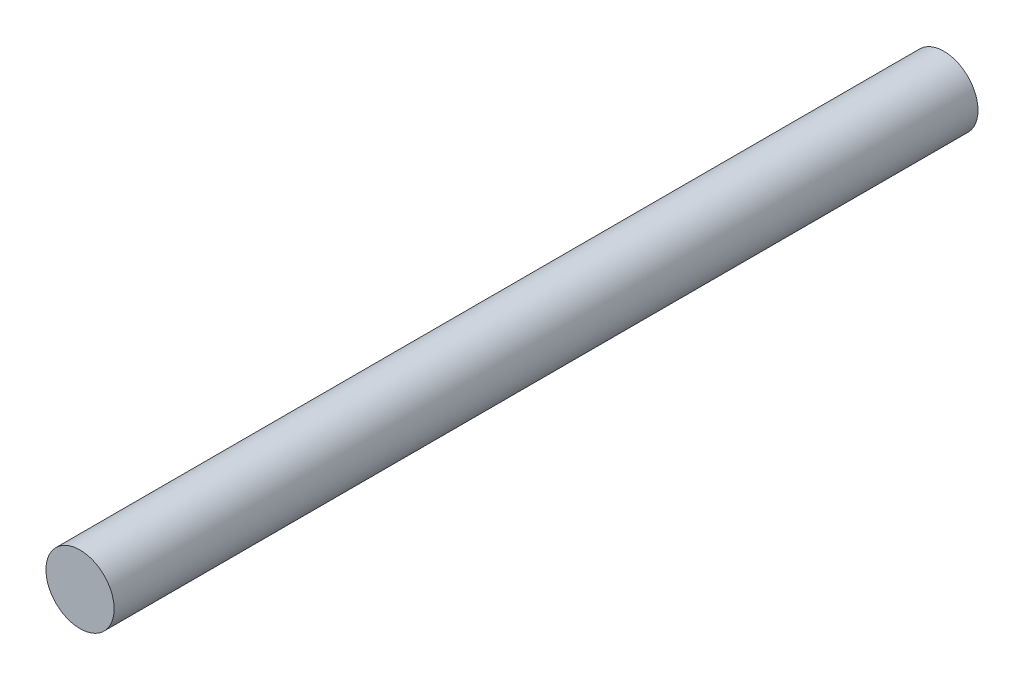
ISO-10303-21;
HEADER;
FILE_DESCRIPTION(('STEP AP214'),'2;1');
FILE_NAME('part.step','',(''),(''),'','','');
FILE_SCHEMA(('AUTOMOTIVE_DESIGN { 1 0 10303 214 1 1 1 1 }'));
ENDSEC;
DATA;
#1=APPLICATION_CONTEXT('core data for automotive mechanical design processes');
#2=APPLICATION_PROTOCOL_DEFINITION('international standard','automotive_design',2000,#1);
#3=PRODUCT_CONTEXT('',#1,'mechanical');
#4=PRODUCT('Part','Part','',(#3));
#5=PRODUCT_RELATED_PRODUCT_CATEGORY('part','',(#4));
#6=PRODUCT_DEFINITION_FORMATION('','',#4);
#7=PRODUCT_DEFINITION_CONTEXT('part definition',#1,'design');
#8=PRODUCT_DEFINITION('design','',#6,#7);
#9=PRODUCT_DEFINITION_SHAPE('','',#8);
#10=(LENGTH_UNIT() NAMED_UNIT(*) SI_UNIT(.MILLI.,.METRE.));
#11=(NAMED_UNIT(*) PLANE_ANGLE_UNIT() SI_UNIT($,.RADIAN.));
#12=(NAMED_UNIT(*) SI_UNIT($,.STERADIAN.) SOLID_ANGLE_UNIT());
#13=UNCERTAINTY_MEASURE_WITH_UNIT(LENGTH_MEASURE(1.E-05),#10,'distance_accuracy_value','');
#14=(GEOMETRIC_REPRESENTATION_CONTEXT(3) GLOBAL_UNCERTAINTY_ASSIGNED_CONTEXT((#13)) GLOBAL_UNIT_ASSIGNED_CONTEXT((#10,
#11,#12)) REPRESENTATION_CONTEXT('',''));
#15=CARTESIAN_POINT('',(0.,0.,0.));
#16=DIRECTION('',(0.,0.,1.));
#17=DIRECTION('',(1.,0.,0.));
#18=AXIS2_PLACEMENT_3D('',#15,#16,#17);
#19=CARTESIAN_POINT('',(0.,0.,38.));
#20=DIRECTION('',(0.,0.,-1.));
#21=DIRECTION('',(-1.,0.,0.));
#22=AXIS2_PLACEMENT_3D('',#19,#20,#21);
#23=CYLINDRICAL_SURFACE('',#22,1.5);
#24=CARTESIAN_POINT('',(0.,0.,38.));
#25=DIRECTION('',(0.,0.,1.));
#26=DIRECTION('',(1.,0.,0.));
#27=AXIS2_PLACEMENT_3D('',#24,#25,#26);
#28=CIRCLE('',#27,1.5);
#29=CARTESIAN_POINT('',(1.5,0.,38.));
#30=VERTEX_POINT('',#29);
#31=EDGE_CURVE('E10',#30,#30,#28,.T.);
#32=ORIENTED_EDGE('',*,*,#31,.F.);
#33=EDGE_LOOP('',(#32));
#34=FACE_BOUND('',#33,.T.);
#35=CARTESIAN_POINT('',(0.,0.,0.));
#36=DIRECTION('',(0.,0.,1.));
#37=DIRECTION('',(1.,0.,0.));
#38=AXIS2_PLACEMENT_3D('',#35,#36,#37);
#39=CIRCLE('',#38,1.5);
#40=CARTESIAN_POINT('',(1.5,0.,0.));
#41=VERTEX_POINT('',#40);
#42=EDGE_CURVE('E35',#41,#41,#39,.T.);
#43=ORIENTED_EDGE('',*,*,#42,.T.);
#44=EDGE_LOOP('',(#43));
#45=FACE_BOUND('',#44,.T.);
#46=ADVANCED_FACE('F32',(#34,#45),#23,.T.);
#47=CARTESIAN_POINT('',(0.,0.,38.));
#48=DIRECTION('',(0.,0.,1.));
#49=DIRECTION('',(1.,0.,0.));
#50=AXIS2_PLACEMENT_3D('',#47,#48,#49);
#51=PLANE('',#50);
#52=ORIENTED_EDGE('',*,*,#31,.T.);
#53=EDGE_LOOP('',(#52));
#54=FACE_BOUND('',#53,.T.);
#55=ADVANCED_FACE('F47',(#54),#51,.T.);
#56=CARTESIAN_POINT('',(0.,0.,0.));
#57=DIRECTION('',(0.,0.,1.));
#58=DIRECTION('',(1.,0.,0.));
#59=AXIS2_PLACEMENT_3D('',#56,#57,#58);
#60=PLANE('',#59);
#61=ORIENTED_EDGE('',*,*,#42,.F.);
#62=EDGE_LOOP('',(#61));
#63=FACE_BOUND('',#62,.T.);
#64=ADVANCED_FACE('F45',(#63),#60,.F.);
#65=CLOSED_SHELL('',(#46,#55,#64));
#66=MANIFOLD_SOLID_BREP('B2',#65);
#67=ADVANCED_BREP_SHAPE_REPRESENTATION('',(#18,#66),#14);
#68=SHAPE_DEFINITION_REPRESENTATION(#9,#67);
ENDSEC;
END-ISO-10303-21;
